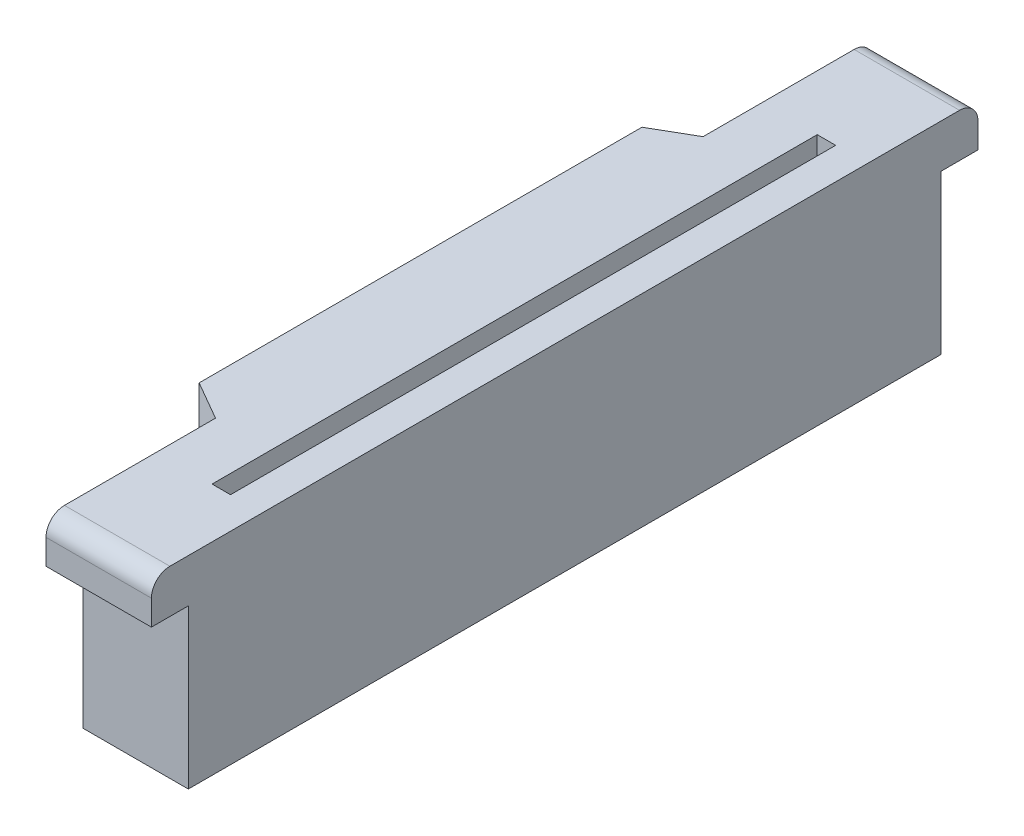
ISO-10303-21;
HEADER;
FILE_DESCRIPTION(('STEP AP214'),'2;1');
FILE_NAME('part.step','',(''),(''),'','','');
FILE_SCHEMA(('AUTOMOTIVE_DESIGN { 1 0 10303 214 1 1 1 1 }'));
ENDSEC;
DATA;
#1=APPLICATION_CONTEXT('core data for automotive mechanical design processes');
#2=APPLICATION_PROTOCOL_DEFINITION('international standard','automotive_design',2000,#1);
#3=PRODUCT_CONTEXT('',#1,'mechanical');
#4=PRODUCT('Part','Part','',(#3));
#5=PRODUCT_RELATED_PRODUCT_CATEGORY('part','',(#4));
#6=PRODUCT_DEFINITION_FORMATION('','',#4);
#7=PRODUCT_DEFINITION_CONTEXT('part definition',#1,'design');
#8=PRODUCT_DEFINITION('design','',#6,#7);
#9=PRODUCT_DEFINITION_SHAPE('','',#8);
#10=(LENGTH_UNIT() NAMED_UNIT(*) SI_UNIT(.MILLI.,.METRE.));
#11=(NAMED_UNIT(*) PLANE_ANGLE_UNIT() SI_UNIT($,.RADIAN.));
#12=(NAMED_UNIT(*) SI_UNIT($,.STERADIAN.) SOLID_ANGLE_UNIT());
#13=UNCERTAINTY_MEASURE_WITH_UNIT(LENGTH_MEASURE(1.E-05),#10,'distance_accuracy_value','');
#14=(GEOMETRIC_REPRESENTATION_CONTEXT(3) GLOBAL_UNCERTAINTY_ASSIGNED_CONTEXT((#13)) GLOBAL_UNIT_ASSIGNED_CONTEXT((#10,
#11,#12)) REPRESENTATION_CONTEXT('',''));
#15=CARTESIAN_POINT('',(0.,0.,0.));
#16=DIRECTION('',(0.,0.,1.));
#17=DIRECTION('',(1.,0.,0.));
#18=AXIS2_PLACEMENT_3D('',#15,#16,#17);
#19=CARTESIAN_POINT('',(-40.4499999999991,-4.70999999998325,17.4500000000167));
#20=DIRECTION('',(0.,0.,1.));
#21=DIRECTION('',(1.,0.,0.));
#22=AXIS2_PLACEMENT_3D('',#19,#20,#21);
#23=PLANE('',#22);
#24=DIRECTION('',(1.,0.,0.));
#25=VECTOR('',#24,1.);
#26=CARTESIAN_POINT('',(-40.4499999999991,-2.46999999998325,17.4500000000167));
#27=LINE('',#26,#25);
#28=CARTESIAN_POINT('',(-40.4499999999991,-2.46999999998325,17.4500000000167));
#29=VERTEX_POINT('',#28);
#30=CARTESIAN_POINT('',(-37.5931729048935,-2.46999999998325,17.4500000000167));
#31=VERTEX_POINT('',#30);
#32=EDGE_CURVE('E41',#29,#31,#27,.T.);
#33=ORIENTED_EDGE('',*,*,#32,.F.);
#34=DIRECTION('',(0.,-1.,0.));
#35=VECTOR('',#34,1.);
#36=CARTESIAN_POINT('',(-40.4499999999991,-2.46999999998325,17.4500000000167));
#37=LINE('',#36,#35);
#38=CARTESIAN_POINT('',(-40.4499999999991,-3.14999999998325,17.4500000000167));
#39=VERTEX_POINT('',#38);
#40=EDGE_CURVE('E11',#29,#39,#37,.T.);
#41=ORIENTED_EDGE('',*,*,#40,.T.);
#42=DIRECTION('',(1.,0.,0.));
#43=VECTOR('',#42,1.);
#44=CARTESIAN_POINT('',(-40.4499999999991,-3.14999999998325,17.4500000000167));
#45=LINE('',#44,#43);
#46=CARTESIAN_POINT('',(-37.5931729048935,-3.14999999998325,17.4500000000167));
#47=VERTEX_POINT('',#46);
#48=EDGE_CURVE('E28',#39,#47,#45,.T.);
#49=ORIENTED_EDGE('',*,*,#48,.T.);
#50=DIRECTION('',(0.,-1.,0.));
#51=VECTOR('',#50,1.);
#52=CARTESIAN_POINT('',(-37.5931729048935,-2.46999999998325,17.4500000000167));
#53=LINE('',#52,#51);
#54=EDGE_CURVE('E175',#31,#47,#53,.T.);
#55=ORIENTED_EDGE('',*,*,#54,.F.);
#56=EDGE_LOOP('',(#33,#41,#49,#55));
#57=FACE_BOUND('',#56,.T.);
#58=ADVANCED_FACE('F17',(#57),#23,.T.);
#59=CARTESIAN_POINT('',(-39.0215864524463,-2.46999999998325,16.9500000000167));
#60=DIRECTION('',(-1.,0.,0.));
#61=DIRECTION('',(0.,0.,1.));
#62=AXIS2_PLACEMENT_3D('',#59,#60,#61);
#63=CYLINDRICAL_SURFACE('',#62,0.5);
#64=ORIENTED_EDGE('',*,*,#32,.T.);
#65=CARTESIAN_POINT('',(-37.5931729048935,-2.46999999998325,16.9500000000167));
#66=DIRECTION('',(-1.,0.,0.));
#67=DIRECTION('',(0.,1.,0.));
#68=AXIS2_PLACEMENT_3D('',#65,#66,#67);
#69=CIRCLE('',#68,0.5);
#70=CARTESIAN_POINT('',(-37.5931729048935,-1.96999999998325,16.9500000000167));
#71=VERTEX_POINT('',#70);
#72=EDGE_CURVE('E288',#31,#71,#69,.T.);
#73=ORIENTED_EDGE('',*,*,#72,.T.);
#74=DIRECTION('',(1.,0.,0.));
#75=VECTOR('',#74,1.);
#76=CARTESIAN_POINT('',(-40.449999999999,-1.96999999998325,16.9500000000167));
#77=LINE('',#76,#75);
#78=CARTESIAN_POINT('',(-40.449999999999,-1.96999999998325,16.9500000000167));
#79=VERTEX_POINT('',#78);
#80=EDGE_CURVE('E267',#79,#71,#77,.T.);
#81=ORIENTED_EDGE('',*,*,#80,.F.);
#82=CARTESIAN_POINT('',(-40.4499999999991,-2.46999999998324,16.9500000000167));
#83=DIRECTION('',(1.,0.,0.));
#84=DIRECTION('',(0.,0.,1.));
#85=AXIS2_PLACEMENT_3D('',#82,#83,#84);
#86=CIRCLE('',#85,0.499999999999994);
#87=EDGE_CURVE('E252',#79,#29,#86,.T.);
#88=ORIENTED_EDGE('',*,*,#87,.T.);
#89=EDGE_LOOP('',(#64,#73,#81,#88));
#90=FACE_BOUND('',#89,.T.);
#91=ADVANCED_FACE('F429',(#90),#63,.T.);
#92=CARTESIAN_POINT('',(-20.9927531529428,-1.96999999998325,6.25000000001675));
#93=DIRECTION('',(0.,1.,0.));
#94=DIRECTION('',(1.,0.,0.));
#95=AXIS2_PLACEMENT_3D('',#92,#93,#94);
#96=PLANE('',#95);
#97=DIRECTION('',(0.,0.,1.));
#98=VECTOR('',#97,1.);
#99=CARTESIAN_POINT('',(-41.499999999999,-1.96999999998325,0.250000000016838));
#100=LINE('',#99,#98);
#101=CARTESIAN_POINT('',(-41.499999999999,-1.96999999998325,0.250000000016838));
#102=VERTEX_POINT('',#101);
#103=CARTESIAN_POINT('',(-41.499999999999,-1.96999999998325,12.2500000000167));
#104=VERTEX_POINT('',#103);
#105=EDGE_CURVE('E248',#102,#104,#100,.T.);
#106=ORIENTED_EDGE('',*,*,#105,.T.);
#107=DIRECTION('',(0.86602540378442,0.,0.500000000000032));
#108=VECTOR('',#107,1.);
#109=CARTESIAN_POINT('',(-41.499999999999,-1.96999999998325,12.2500000000167));
#110=LINE('',#109,#108);
#111=CARTESIAN_POINT('',(-40.4499999999991,-1.96999999998325,12.8562177826658));
#112=VERTEX_POINT('',#111);
#113=EDGE_CURVE('E253',#104,#112,#110,.T.);
#114=ORIENTED_EDGE('',*,*,#113,.T.);
#115=DIRECTION('',(0.,0.,1.));
#116=VECTOR('',#115,1.);
#117=CARTESIAN_POINT('',(-40.4499999999991,-1.96999999998325,12.8562177826658));
#118=LINE('',#117,#116);
#119=EDGE_CURVE('E258',#112,#79,#118,.T.);
#120=ORIENTED_EDGE('',*,*,#119,.T.);
#121=ORIENTED_EDGE('',*,*,#80,.T.);
#122=DIRECTION('',(0.,0.,-1.));
#123=VECTOR('',#122,1.);
#124=CARTESIAN_POINT('',(-37.5931729048935,-1.96999999998325,16.9500000000167));
#125=LINE('',#124,#123);
#126=CARTESIAN_POINT('',(-37.5931729048935,-1.96999999998325,-4.44999999998326));
#127=VERTEX_POINT('',#126);
#128=EDGE_CURVE('E274',#71,#127,#125,.T.);
#129=ORIENTED_EDGE('',*,*,#128,.T.);
#130=DIRECTION('',(-1.,0.,0.));
#131=VECTOR('',#130,1.);
#132=CARTESIAN_POINT('',(-37.5931729048935,-1.96999999998325,-4.44999999998326));
#133=LINE('',#132,#131);
#134=CARTESIAN_POINT('',(-40.4499999999991,-1.96999999998325,-4.44999999998327));
#135=VERTEX_POINT('',#134);
#136=EDGE_CURVE('E234',#127,#135,#133,.T.);
#137=ORIENTED_EDGE('',*,*,#136,.T.);
#138=DIRECTION('',(0.,0.,1.));
#139=VECTOR('',#138,1.);
#140=CARTESIAN_POINT('',(-40.4499999999991,-1.96999999998325,-4.44999999998327));
#141=LINE('',#140,#139);
#142=CARTESIAN_POINT('',(-40.4499999999991,-1.96999999998325,-0.356217782632266));
#143=VERTEX_POINT('',#142);
#144=EDGE_CURVE('E193',#135,#143,#141,.T.);
#145=ORIENTED_EDGE('',*,*,#144,.T.);
#146=DIRECTION('',(-0.866025403784419,0.,0.500000000000035));
#147=VECTOR('',#146,1.);
#148=CARTESIAN_POINT('',(-40.4499999999991,-1.96999999998325,-0.356217782632266));
#149=LINE('',#148,#147);
#150=EDGE_CURVE('E182',#143,#102,#149,.T.);
#151=ORIENTED_EDGE('',*,*,#150,.T.);
#152=EDGE_LOOP('',(#106,#114,#120,#121,#129,#137,#145,#151));
#153=FACE_BOUND('',#152,.T.);
#154=DIRECTION('',(1.,0.,0.));
#155=VECTOR('',#154,1.);
#156=CARTESIAN_POINT('',(-38.9499999999991,-1.96999999998325,-1.94999999998328));
#157=LINE('',#156,#155);
#158=CARTESIAN_POINT('',(-38.9499999999991,-1.96999999998325,-1.94999999998328));
#159=VERTEX_POINT('',#158);
#160=CARTESIAN_POINT('',(-38.4499999999991,-1.96999999998325,-1.94999999998328));
#161=VERTEX_POINT('',#160);
#162=EDGE_CURVE('E179',#159,#161,#157,.T.);
#163=ORIENTED_EDGE('',*,*,#162,.T.);
#164=DIRECTION('',(0.,0.,1.));
#165=VECTOR('',#164,1.);
#166=CARTESIAN_POINT('',(-38.4499999999991,-1.96999999998325,-1.94999999998328));
#167=LINE('',#166,#165);
#168=CARTESIAN_POINT('',(-38.4499999999991,-1.96999999998325,14.4500000000167));
#169=VERTEX_POINT('',#168);
#170=EDGE_CURVE('E183',#161,#169,#167,.T.);
#171=ORIENTED_EDGE('',*,*,#170,.T.);
#172=DIRECTION('',(-1.,0.,0.));
#173=VECTOR('',#172,1.);
#174=CARTESIAN_POINT('',(-38.4499999999991,-1.96999999998325,14.4500000000167));
#175=LINE('',#174,#173);
#176=CARTESIAN_POINT('',(-38.9499999999991,-1.96999999998325,14.4500000000167));
#177=VERTEX_POINT('',#176);
#178=EDGE_CURVE('E195',#169,#177,#175,.T.);
#179=ORIENTED_EDGE('',*,*,#178,.T.);
#180=DIRECTION('',(0.,0.,-1.));
#181=VECTOR('',#180,1.);
#182=CARTESIAN_POINT('',(-38.9499999999991,-1.96999999998325,14.4500000000167));
#183=LINE('',#182,#181);
#184=EDGE_CURVE('E202',#177,#159,#183,.T.);
#185=ORIENTED_EDGE('',*,*,#184,.T.);
#186=EDGE_LOOP('',(#163,#171,#179,#185));
#187=FACE_BOUND('',#186,.T.);
#188=ADVANCED_FACE('F383',(#153,#187),#96,.T.);
#189=CARTESIAN_POINT('',(-38.9499999999991,-4.70999999998325,-1.94999999998328));
#190=DIRECTION('',(0.,0.,1.));
#191=DIRECTION('',(1.,0.,0.));
#192=AXIS2_PLACEMENT_3D('',#189,#190,#191);
#193=PLANE('',#192);
#194=DIRECTION('',(0.,-1.,0.));
#195=VECTOR('',#194,1.);
#196=CARTESIAN_POINT('',(-38.9499999999991,-1.96999999998325,-1.94999999998328));
#197=LINE('',#196,#195);
#198=CARTESIAN_POINT('',(-38.9499999999991,-2.96999999998325,-1.94999999998328));
#199=VERTEX_POINT('',#198);
#200=EDGE_CURVE('E21',#159,#199,#197,.T.);
#201=ORIENTED_EDGE('',*,*,#200,.T.);
#202=DIRECTION('',(0.44721359549996,0.894427190999915,0.));
#203=VECTOR('',#202,1.);
#204=CARTESIAN_POINT('',(-38.9499999999991,-2.96999999998325,-1.94999999998328));
#205=LINE('',#204,#203);
#206=EDGE_CURVE('E206',#199,#161,#205,.T.);
#207=ORIENTED_EDGE('',*,*,#206,.T.);
#208=ORIENTED_EDGE('',*,*,#162,.F.);
#209=EDGE_LOOP('',(#201,#207,#208));
#210=FACE_BOUND('',#209,.T.);
#211=ADVANCED_FACE('F452',(#210),#193,.T.);
#212=CARTESIAN_POINT('',(-38.9499999999991,-4.70999999998325,14.4500000000167));
#213=DIRECTION('',(1.,0.,0.));
#214=DIRECTION('',(0.,1.,0.));
#215=AXIS2_PLACEMENT_3D('',#212,#213,#214);
#216=PLANE('',#215);
#217=DIRECTION('',(0.,0.,1.));
#218=VECTOR('',#217,1.);
#219=CARTESIAN_POINT('',(-38.9499999999991,-2.96999999998325,-1.94999999998328));
#220=LINE('',#219,#218);
#221=CARTESIAN_POINT('',(-38.9499999999991,-2.96999999998325,14.4500000000167));
#222=VERTEX_POINT('',#221);
#223=EDGE_CURVE('E238',#199,#222,#220,.T.);
#224=ORIENTED_EDGE('',*,*,#223,.F.);
#225=ORIENTED_EDGE('',*,*,#200,.F.);
#226=ORIENTED_EDGE('',*,*,#184,.F.);
#227=DIRECTION('',(0.,-1.,0.));
#228=VECTOR('',#227,1.);
#229=CARTESIAN_POINT('',(-38.9499999999991,-1.96999999998325,14.4500000000167));
#230=LINE('',#229,#228);
#231=EDGE_CURVE('E209',#177,#222,#230,.T.);
#232=ORIENTED_EDGE('',*,*,#231,.T.);
#233=EDGE_LOOP('',(#224,#225,#226,#232));
#234=FACE_BOUND('',#233,.T.);
#235=ADVANCED_FACE('F454',(#234),#216,.T.);
#236=CARTESIAN_POINT('',(-37.5931729048935,-4.70999999998325,14.4500000000167));
#237=DIRECTION('',(0.,0.,-1.));
#238=DIRECTION('',(0.,-1.,0.));
#239=AXIS2_PLACEMENT_3D('',#236,#237,#238);
#240=PLANE('',#239);
#241=ORIENTED_EDGE('',*,*,#178,.F.);
#242=DIRECTION('',(0.44721359549996,0.894427190999915,0.));
#243=VECTOR('',#242,1.);
#244=CARTESIAN_POINT('',(-38.9499999999991,-2.96999999998325,14.4500000000167));
#245=LINE('',#244,#243);
#246=EDGE_CURVE('E283',#222,#169,#245,.T.);
#247=ORIENTED_EDGE('',*,*,#246,.F.);
#248=ORIENTED_EDGE('',*,*,#231,.F.);
#249=EDGE_LOOP('',(#241,#247,#248));
#250=FACE_BOUND('',#249,.T.);
#251=ADVANCED_FACE('F448',(#250),#240,.T.);
#252=CARTESIAN_POINT('',(-38.9499999999991,-2.96999999998325,6.2500000000167));
#253=DIRECTION('',(-0.894427190999915,0.44721359549996,0.));
#254=DIRECTION('',(0.,0.,1.));
#255=AXIS2_PLACEMENT_3D('',#252,#253,#254);
#256=PLANE('',#255);
#257=ORIENTED_EDGE('',*,*,#223,.T.);
#258=ORIENTED_EDGE('',*,*,#246,.T.);
#259=ORIENTED_EDGE('',*,*,#170,.F.);
#260=ORIENTED_EDGE('',*,*,#206,.F.);
#261=EDGE_LOOP('',(#257,#258,#259,#260));
#262=FACE_BOUND('',#261,.T.);
#263=ADVANCED_FACE('F445',(#262),#256,.T.);
#264=CARTESIAN_POINT('',(-41.499999999999,-4.70999999998325,0.250000000016838));
#265=DIRECTION('',(-1.,0.,0.));
#266=DIRECTION('',(0.,0.,1.));
#267=AXIS2_PLACEMENT_3D('',#264,#265,#266);
#268=PLANE('',#267);
#269=DIRECTION('',(0.,0.,1.));
#270=VECTOR('',#269,1.);
#271=CARTESIAN_POINT('',(-41.499999999999,-3.14999999998325,0.250000000016838));
#272=LINE('',#271,#270);
#273=CARTESIAN_POINT('',(-41.499999999999,-3.14999999998325,0.250000000016838));
#274=VERTEX_POINT('',#273);
#275=CARTESIAN_POINT('',(-41.4999999999991,-3.14999999998325,12.2500000000167));
#276=VERTEX_POINT('',#275);
#277=EDGE_CURVE('E279',#274,#276,#272,.T.);
#278=ORIENTED_EDGE('',*,*,#277,.T.);
#279=DIRECTION('',(0.,-1.,0.));
#280=VECTOR('',#279,1.);
#281=CARTESIAN_POINT('',(-41.4999999999991,-1.96999999998325,12.2500000000167));
#282=LINE('',#281,#280);
#283=EDGE_CURVE('E178',#104,#276,#282,.T.);
#284=ORIENTED_EDGE('',*,*,#283,.F.);
#285=ORIENTED_EDGE('',*,*,#105,.F.);
#286=DIRECTION('',(0.,-1.,0.));
#287=VECTOR('',#286,1.);
#288=CARTESIAN_POINT('',(-41.499999999999,-1.96999999998325,0.250000000016838));
#289=LINE('',#288,#287);
#290=EDGE_CURVE('E163',#102,#274,#289,.T.);
#291=ORIENTED_EDGE('',*,*,#290,.T.);
#292=EDGE_LOOP('',(#278,#284,#285,#291));
#293=FACE_BOUND('',#292,.T.);
#294=ADVANCED_FACE('F441',(#293),#268,.T.);
#295=CARTESIAN_POINT('',(-40.4499999999991,-3.14999999998325,6.25000000001671));
#296=DIRECTION('',(0.,-1.,0.));
#297=DIRECTION('',(0.,0.,-1.));
#298=AXIS2_PLACEMENT_3D('',#295,#296,#297);
#299=PLANE('',#298);
#300=DIRECTION('',(0.866025403784441,0.,0.5));
#301=VECTOR('',#300,1.);
#302=CARTESIAN_POINT('',(-41.4999999999991,-3.14999999998325,12.2500000000167));
#303=LINE('',#302,#301);
#304=CARTESIAN_POINT('',(-40.4499999999991,-3.14999999998325,12.8562177826658));
#305=VERTEX_POINT('',#304);
#306=EDGE_CURVE('E150',#276,#305,#303,.T.);
#307=ORIENTED_EDGE('',*,*,#306,.F.);
#308=ORIENTED_EDGE('',*,*,#277,.F.);
#309=DIRECTION('',(-0.866025403784419,0.,0.500000000000035));
#310=VECTOR('',#309,1.);
#311=CARTESIAN_POINT('',(-40.4499999999991,-3.14999999998325,-0.356217782632266));
#312=LINE('',#311,#310);
#313=CARTESIAN_POINT('',(-40.4499999999991,-3.14999999998325,-0.356217782632266));
#314=VERTEX_POINT('',#313);
#315=EDGE_CURVE('E210',#314,#274,#312,.T.);
#316=ORIENTED_EDGE('',*,*,#315,.F.);
#317=DIRECTION('',(0.,0.,1.));
#318=VECTOR('',#317,1.);
#319=CARTESIAN_POINT('',(-40.4499999999991,-3.14999999998325,-0.356217782632266));
#320=LINE('',#319,#318);
#321=EDGE_CURVE('E214',#314,#305,#320,.T.);
#322=ORIENTED_EDGE('',*,*,#321,.T.);
#323=EDGE_LOOP('',(#307,#308,#316,#322));
#324=FACE_BOUND('',#323,.T.);
#325=ADVANCED_FACE('F377',(#324),#299,.T.);
#326=CARTESIAN_POINT('',(-40.4499999999991,-4.70999999998325,-0.356217782632266));
#327=DIRECTION('',(-0.500000000000035,0.,-0.866025403784419));
#328=DIRECTION('',(-0.866025403784419,0.,0.500000000000035));
#329=AXIS2_PLACEMENT_3D('',#326,#327,#328);
#330=PLANE('',#329);
#331=ORIENTED_EDGE('',*,*,#315,.T.);
#332=ORIENTED_EDGE('',*,*,#290,.F.);
#333=ORIENTED_EDGE('',*,*,#150,.F.);
#334=DIRECTION('',(0.,-1.,0.));
#335=VECTOR('',#334,1.);
#336=CARTESIAN_POINT('',(-40.4499999999991,-1.96999999998325,-0.356217782632266));
#337=LINE('',#336,#335);
#338=EDGE_CURVE('E215',#143,#314,#337,.T.);
#339=ORIENTED_EDGE('',*,*,#338,.T.);
#340=EDGE_LOOP('',(#331,#332,#333,#339));
#341=FACE_BOUND('',#340,.T.);
#342=ADVANCED_FACE('F381',(#341),#330,.T.);
#343=CARTESIAN_POINT('',(-39.0215864524463,-2.46999999998325,-4.44999999998327));
#344=DIRECTION('',(1.,0.,0.));
#345=DIRECTION('',(0.,0.,-1.));
#346=AXIS2_PLACEMENT_3D('',#343,#344,#345);
#347=CYLINDRICAL_SURFACE('',#346,0.49999999999999);
#348=DIRECTION('',(-1.,0.,0.));
#349=VECTOR('',#348,1.);
#350=CARTESIAN_POINT('',(-37.5931729048935,-2.46999999998325,-4.94999999998326));
#351=LINE('',#350,#349);
#352=CARTESIAN_POINT('',(-37.5931729048935,-2.46999999998325,-4.94999999998326));
#353=VERTEX_POINT('',#352);
#354=CARTESIAN_POINT('',(-40.4499999999991,-2.46999999998325,-4.94999999998328));
#355=VERTEX_POINT('',#354);
#356=EDGE_CURVE('E301',#353,#355,#351,.T.);
#357=ORIENTED_EDGE('',*,*,#356,.T.);
#358=CARTESIAN_POINT('',(-40.4499999999991,-2.46999999998325,-4.44999999998327));
#359=DIRECTION('',(1.,0.,0.));
#360=DIRECTION('',(0.,1.,0.));
#361=AXIS2_PLACEMENT_3D('',#358,#359,#360);
#362=CIRCLE('',#361,0.5);
#363=EDGE_CURVE('E172',#355,#135,#362,.T.);
#364=ORIENTED_EDGE('',*,*,#363,.T.);
#365=ORIENTED_EDGE('',*,*,#136,.F.);
#366=CARTESIAN_POINT('',(-37.5931729048935,-2.46999999998324,-4.44999999998327));
#367=DIRECTION('',(-1.,0.,0.));
#368=DIRECTION('',(0.,0.,-1.));
#369=AXIS2_PLACEMENT_3D('',#366,#367,#368);
#370=CIRCLE('',#369,0.499999999999993);
#371=EDGE_CURVE('E169',#127,#353,#370,.T.);
#372=ORIENTED_EDGE('',*,*,#371,.T.);
#373=EDGE_LOOP('',(#357,#364,#365,#372));
#374=FACE_BOUND('',#373,.T.);
#375=ADVANCED_FACE('F392',(#374),#347,.T.);
#376=CARTESIAN_POINT('',(-37.5931729048935,-4.70999999998325,-4.94999999998326));
#377=DIRECTION('',(0.,0.,-1.));
#378=DIRECTION('',(0.,-1.,0.));
#379=AXIS2_PLACEMENT_3D('',#376,#377,#378);
#380=PLANE('',#379);
#381=ORIENTED_EDGE('',*,*,#356,.F.);
#382=DIRECTION('',(0.,-1.,0.));
#383=VECTOR('',#382,1.);
#384=CARTESIAN_POINT('',(-37.5931729048935,-2.46999999998325,-4.94999999998326));
#385=LINE('',#384,#383);
#386=CARTESIAN_POINT('',(-37.5931729048935,-3.14999999998324,-4.94999999998326));
#387=VERTEX_POINT('',#386);
#388=EDGE_CURVE('E173',#353,#387,#385,.T.);
#389=ORIENTED_EDGE('',*,*,#388,.T.);
#390=DIRECTION('',(-1.,0.,0.));
#391=VECTOR('',#390,1.);
#392=CARTESIAN_POINT('',(-37.5931729048935,-3.14999999998325,-4.94999999998326));
#393=LINE('',#392,#391);
#394=CARTESIAN_POINT('',(-40.449999999999,-3.14999999998324,-4.94999999998328));
#395=VERTEX_POINT('',#394);
#396=EDGE_CURVE('E216',#387,#395,#393,.T.);
#397=ORIENTED_EDGE('',*,*,#396,.T.);
#398=DIRECTION('',(0.,-1.,0.));
#399=VECTOR('',#398,1.);
#400=CARTESIAN_POINT('',(-40.449999999999,-2.46999999998325,-4.94999999998328));
#401=LINE('',#400,#399);
#402=EDGE_CURVE('E310',#355,#395,#401,.T.);
#403=ORIENTED_EDGE('',*,*,#402,.F.);
#404=EDGE_LOOP('',(#381,#389,#397,#403));
#405=FACE_BOUND('',#404,.T.);
#406=ADVANCED_FACE('F396',(#405),#380,.T.);
#407=CARTESIAN_POINT('',(-39.5465864524462,-3.14999999998325,-3.94999999998327));
#408=DIRECTION('',(0.,-1.,0.));
#409=DIRECTION('',(0.,0.,-1.));
#410=AXIS2_PLACEMENT_3D('',#407,#408,#409);
#411=PLANE('',#410);
#412=ORIENTED_EDGE('',*,*,#396,.F.);
#413=DIRECTION('',(0.,0.,-1.));
#414=VECTOR('',#413,1.);
#415=CARTESIAN_POINT('',(-37.5931729048935,-3.14999999998325,-3.94999999998326));
#416=LINE('',#415,#414);
#417=CARTESIAN_POINT('',(-37.5931729048935,-3.14999999998325,-3.94999999998326));
#418=VERTEX_POINT('',#417);
#419=EDGE_CURVE('E226',#418,#387,#416,.T.);
#420=ORIENTED_EDGE('',*,*,#419,.F.);
#421=DIRECTION('',(-1.,0.,0.));
#422=VECTOR('',#421,1.);
#423=CARTESIAN_POINT('',(-37.5931729048935,-3.14999999998325,-3.94999999998326));
#424=LINE('',#423,#422);
#425=CARTESIAN_POINT('',(-40.4499999999991,-3.14999999998325,-3.94999999998327));
#426=VERTEX_POINT('',#425);
#427=EDGE_CURVE('E220',#418,#426,#424,.T.);
#428=ORIENTED_EDGE('',*,*,#427,.T.);
#429=DIRECTION('',(0.,0.,1.));
#430=VECTOR('',#429,1.);
#431=CARTESIAN_POINT('',(-40.4499999999991,-3.14999999998325,-4.94999999998328));
#432=LINE('',#431,#430);
#433=EDGE_CURVE('E230',#395,#426,#432,.T.);
#434=ORIENTED_EDGE('',*,*,#433,.F.);
#435=EDGE_LOOP('',(#412,#420,#428,#434));
#436=FACE_BOUND('',#435,.T.);
#437=ADVANCED_FACE('F415',(#436),#411,.T.);
#438=CARTESIAN_POINT('',(-39.5465864524462,-7.96661692123128,-3.94999999998327));
#439=DIRECTION('',(0.,0.,-1.));
#440=DIRECTION('',(0.,-1.,0.));
#441=AXIS2_PLACEMENT_3D('',#438,#439,#440);
#442=PLANE('',#441);
#443=DIRECTION('',(0.,1.,0.));
#444=VECTOR('',#443,1.);
#445=CARTESIAN_POINT('',(-37.5931729048935,-7.44999999998324,-3.94999999998326));
#446=LINE('',#445,#444);
#447=CARTESIAN_POINT('',(-37.5931729048935,-7.44999999998324,-3.94999999998326));
#448=VERTEX_POINT('',#447);
#449=EDGE_CURVE('E242',#448,#418,#446,.T.);
#450=ORIENTED_EDGE('',*,*,#449,.F.);
#451=DIRECTION('',(-1.,0.,0.));
#452=VECTOR('',#451,1.);
#453=CARTESIAN_POINT('',(-37.5931729048935,-7.44999999998324,-3.94999999998326));
#454=LINE('',#453,#452);
#455=CARTESIAN_POINT('',(-40.4499999999991,-7.44999999998324,-3.94999999998327));
#456=VERTEX_POINT('',#455);
#457=EDGE_CURVE('E149',#448,#456,#454,.T.);
#458=ORIENTED_EDGE('',*,*,#457,.T.);
#459=DIRECTION('',(0.,-1.,0.));
#460=VECTOR('',#459,1.);
#461=CARTESIAN_POINT('',(-40.4499999999991,-3.14999999998325,-3.94999999998327));
#462=LINE('',#461,#460);
#463=EDGE_CURVE('E135',#426,#456,#462,.T.);
#464=ORIENTED_EDGE('',*,*,#463,.F.);
#465=ORIENTED_EDGE('',*,*,#427,.F.);
#466=EDGE_LOOP('',(#450,#458,#464,#465));
#467=FACE_BOUND('',#466,.T.);
#468=ADVANCED_FACE('F416',(#467),#442,.T.);
#469=CARTESIAN_POINT('',(-39.3820261353081,-7.44999999998324,17.4500000000167));
#470=DIRECTION('',(0.,-1.,0.));
#471=DIRECTION('',(0.,0.,-1.));
#472=AXIS2_PLACEMENT_3D('',#469,#470,#471);
#473=PLANE('',#472);
#474=DIRECTION('',(0.,0.,-1.));
#475=VECTOR('',#474,1.);
#476=CARTESIAN_POINT('',(-37.5931729048935,-7.44999999998324,16.4500000000167));
#477=LINE('',#476,#475);
#478=CARTESIAN_POINT('',(-37.5931729048935,-7.44999999998325,16.4500000000167));
#479=VERTEX_POINT('',#478);
#480=EDGE_CURVE('E145',#479,#448,#477,.T.);
#481=ORIENTED_EDGE('',*,*,#480,.F.);
#482=DIRECTION('',(1.,0.,0.));
#483=VECTOR('',#482,1.);
#484=CARTESIAN_POINT('',(-40.4499999999991,-7.44999999998324,16.4500000000167));
#485=LINE('',#484,#483);
#486=CARTESIAN_POINT('',(-40.4499999999991,-7.44999999998325,16.4500000000167));
#487=VERTEX_POINT('',#486);
#488=EDGE_CURVE('E142',#487,#479,#485,.T.);
#489=ORIENTED_EDGE('',*,*,#488,.F.);
#490=DIRECTION('',(0.,0.,1.));
#491=VECTOR('',#490,1.);
#492=CARTESIAN_POINT('',(-40.4499999999991,-7.44999999998324,-3.94999999998327));
#493=LINE('',#492,#491);
#494=EDGE_CURVE('E126',#456,#487,#493,.T.);
#495=ORIENTED_EDGE('',*,*,#494,.F.);
#496=ORIENTED_EDGE('',*,*,#457,.F.);
#497=EDGE_LOOP('',(#481,#489,#495,#496));
#498=FACE_BOUND('',#497,.T.);
#499=ADVANCED_FACE('F143',(#498),#473,.T.);
#500=CARTESIAN_POINT('',(-39.5465864524462,-7.96661692123128,16.4500000000167));
#501=DIRECTION('',(0.,0.,1.));
#502=DIRECTION('',(1.,0.,0.));
#503=AXIS2_PLACEMENT_3D('',#500,#501,#502);
#504=PLANE('',#503);
#505=DIRECTION('',(0.,-1.,0.));
#506=VECTOR('',#505,1.);
#507=CARTESIAN_POINT('',(-37.5931729048935,-3.14999999998325,16.4500000000167));
#508=LINE('',#507,#506);
#509=CARTESIAN_POINT('',(-37.5931729048935,-3.14999999998325,16.4500000000167));
#510=VERTEX_POINT('',#509);
#511=EDGE_CURVE('E165',#510,#479,#508,.T.);
#512=ORIENTED_EDGE('',*,*,#511,.F.);
#513=DIRECTION('',(1.,0.,0.));
#514=VECTOR('',#513,1.);
#515=CARTESIAN_POINT('',(-40.4499999999991,-3.14999999998325,16.4500000000167));
#516=LINE('',#515,#514);
#517=CARTESIAN_POINT('',(-40.4499999999991,-3.14999999998325,16.4500000000167));
#518=VERTEX_POINT('',#517);
#519=EDGE_CURVE('E118',#518,#510,#516,.T.);
#520=ORIENTED_EDGE('',*,*,#519,.F.);
#521=DIRECTION('',(0.,1.,0.));
#522=VECTOR('',#521,1.);
#523=CARTESIAN_POINT('',(-40.4499999999991,-7.44999999998324,16.4500000000167));
#524=LINE('',#523,#522);
#525=EDGE_CURVE('E132',#487,#518,#524,.T.);
#526=ORIENTED_EDGE('',*,*,#525,.F.);
#527=ORIENTED_EDGE('',*,*,#488,.T.);
#528=EDGE_LOOP('',(#512,#520,#526,#527));
#529=FACE_BOUND('',#528,.T.);
#530=ADVANCED_FACE('F152',(#529),#504,.T.);
#531=CARTESIAN_POINT('',(-41.4999999999991,-4.70999999998325,12.2500000000167));
#532=DIRECTION('',(-0.499999999999962,0.,0.866025403784461));
#533=DIRECTION('',(0.,1.,0.));
#534=AXIS2_PLACEMENT_3D('',#531,#532,#533);
#535=PLANE('',#534);
#536=ORIENTED_EDGE('',*,*,#306,.T.);
#537=DIRECTION('',(0.,-1.,0.));
#538=VECTOR('',#537,1.);
#539=CARTESIAN_POINT('',(-40.4499999999991,-1.96999999998325,12.8562177826658));
#540=LINE('',#539,#538);
#541=EDGE_CURVE('E227',#112,#305,#540,.T.);
#542=ORIENTED_EDGE('',*,*,#541,.F.);
#543=ORIENTED_EDGE('',*,*,#113,.F.);
#544=ORIENTED_EDGE('',*,*,#283,.T.);
#545=EDGE_LOOP('',(#536,#542,#543,#544));
#546=FACE_BOUND('',#545,.T.);
#547=ADVANCED_FACE('F19',(#546),#535,.T.);
#548=CARTESIAN_POINT('',(-37.5931729048935,-4.70999999998325,17.4500000000167));
#549=DIRECTION('',(1.,0.,0.));
#550=DIRECTION('',(0.,1.,0.));
#551=AXIS2_PLACEMENT_3D('',#548,#549,#550);
#552=PLANE('',#551);
#553=ORIENTED_EDGE('',*,*,#72,.F.);
#554=ORIENTED_EDGE('',*,*,#54,.T.);
#555=DIRECTION('',(0.,0.,-1.));
#556=VECTOR('',#555,1.);
#557=CARTESIAN_POINT('',(-37.5931729048935,-3.14999999998325,17.4500000000167));
#558=LINE('',#557,#556);
#559=EDGE_CURVE('E168',#47,#510,#558,.T.);
#560=ORIENTED_EDGE('',*,*,#559,.T.);
#561=ORIENTED_EDGE('',*,*,#511,.T.);
#562=ORIENTED_EDGE('',*,*,#480,.T.);
#563=ORIENTED_EDGE('',*,*,#449,.T.);
#564=ORIENTED_EDGE('',*,*,#419,.T.);
#565=ORIENTED_EDGE('',*,*,#388,.F.);
#566=ORIENTED_EDGE('',*,*,#371,.F.);
#567=ORIENTED_EDGE('',*,*,#128,.F.);
#568=EDGE_LOOP('',(#553,#554,#560,#561,#562,#563,#564,#565,#566,#567));
#569=FACE_BOUND('',#568,.T.);
#570=ADVANCED_FACE('F334',(#569),#552,.T.);
#571=CARTESIAN_POINT('',(-39.5465864524462,-3.14999999998325,16.4500000000167));
#572=DIRECTION('',(0.,-1.,0.));
#573=DIRECTION('',(0.,0.,-1.));
#574=AXIS2_PLACEMENT_3D('',#571,#572,#573);
#575=PLANE('',#574);
#576=ORIENTED_EDGE('',*,*,#559,.F.);
#577=ORIENTED_EDGE('',*,*,#48,.F.);
#578=DIRECTION('',(0.,0.,1.));
#579=VECTOR('',#578,1.);
#580=CARTESIAN_POINT('',(-40.4499999999991,-3.14999999998325,16.4500000000167));
#581=LINE('',#580,#579);
#582=EDGE_CURVE('E154',#518,#39,#581,.T.);
#583=ORIENTED_EDGE('',*,*,#582,.F.);
#584=ORIENTED_EDGE('',*,*,#519,.T.);
#585=EDGE_LOOP('',(#576,#577,#583,#584));
#586=FACE_BOUND('',#585,.T.);
#587=ADVANCED_FACE('F444',(#586),#575,.T.);
#588=CARTESIAN_POINT('',(-40.4499999999991,-4.89630399664546,-7.18999999998328));
#589=DIRECTION('',(-1.,0.,0.));
#590=DIRECTION('',(0.,0.,1.));
#591=AXIS2_PLACEMENT_3D('',#588,#589,#590);
#592=PLANE('',#591);
#593=ORIENTED_EDGE('',*,*,#541,.T.);
#594=ORIENTED_EDGE('',*,*,#321,.F.);
#595=ORIENTED_EDGE('',*,*,#338,.F.);
#596=ORIENTED_EDGE('',*,*,#144,.F.);
#597=ORIENTED_EDGE('',*,*,#363,.F.);
#598=ORIENTED_EDGE('',*,*,#402,.T.);
#599=ORIENTED_EDGE('',*,*,#433,.T.);
#600=ORIENTED_EDGE('',*,*,#463,.T.);
#601=ORIENTED_EDGE('',*,*,#494,.T.);
#602=ORIENTED_EDGE('',*,*,#525,.T.);
#603=ORIENTED_EDGE('',*,*,#582,.T.);
#604=ORIENTED_EDGE('',*,*,#40,.F.);
#605=ORIENTED_EDGE('',*,*,#87,.F.);
#606=ORIENTED_EDGE('',*,*,#119,.F.);
#607=EDGE_LOOP('',(#593,#594,#595,#596,#597,#598,#599,#600,#601,#602,#603,#604,#605,#606));
#608=FACE_BOUND('',#607,.T.);
#609=ADVANCED_FACE('F129',(#608),#592,.T.);
#610=CLOSED_SHELL('',(#58,#91,#188,#211,#235,#251,#263,#294,#325,#342,#375,#406,#437,#468,#499,
#530,#547,#570,#587,#609));
#611=MANIFOLD_SOLID_BREP('B1',#610);
#612=ADVANCED_BREP_SHAPE_REPRESENTATION('',(#18,#611),#14);
#613=SHAPE_DEFINITION_REPRESENTATION(#9,#612);
ENDSEC;
END-ISO-10303-21;
